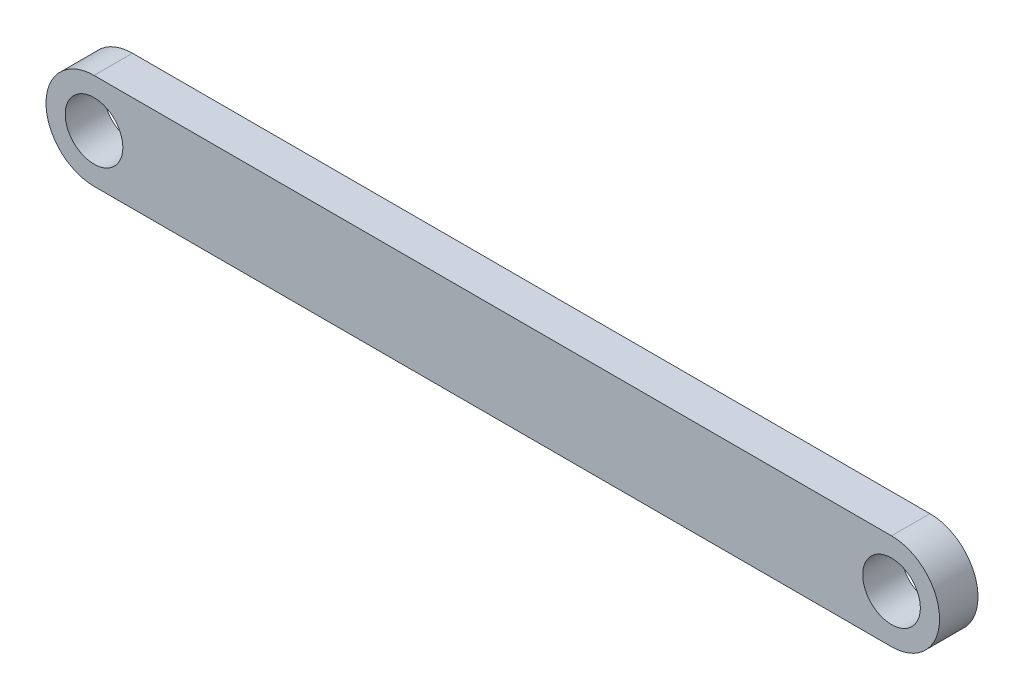
ISO-10303-21;
HEADER;
FILE_DESCRIPTION(('STEP AP214'),'2;1');
FILE_NAME('part.step','',(''),(''),'','','');
FILE_SCHEMA(('AUTOMOTIVE_DESIGN { 1 0 10303 214 1 1 1 1 }'));
ENDSEC;
DATA;
#1=APPLICATION_CONTEXT('core data for automotive mechanical design processes');
#2=APPLICATION_PROTOCOL_DEFINITION('international standard','automotive_design',2000,#1);
#3=PRODUCT_CONTEXT('',#1,'mechanical');
#4=PRODUCT('Part','Part','',(#3));
#5=PRODUCT_RELATED_PRODUCT_CATEGORY('part','',(#4));
#6=PRODUCT_DEFINITION_FORMATION('','',#4);
#7=PRODUCT_DEFINITION_CONTEXT('part definition',#1,'design');
#8=PRODUCT_DEFINITION('design','',#6,#7);
#9=PRODUCT_DEFINITION_SHAPE('','',#8);
#10=(LENGTH_UNIT() NAMED_UNIT(*) SI_UNIT(.MILLI.,.METRE.));
#11=(NAMED_UNIT(*) PLANE_ANGLE_UNIT() SI_UNIT($,.RADIAN.));
#12=(NAMED_UNIT(*) SI_UNIT($,.STERADIAN.) SOLID_ANGLE_UNIT());
#13=UNCERTAINTY_MEASURE_WITH_UNIT(LENGTH_MEASURE(1.E-05),#10,'distance_accuracy_value','');
#14=(GEOMETRIC_REPRESENTATION_CONTEXT(3) GLOBAL_UNCERTAINTY_ASSIGNED_CONTEXT((#13)) GLOBAL_UNIT_ASSIGNED_CONTEXT((#10,
#11,#12)) REPRESENTATION_CONTEXT('',''));
#15=CARTESIAN_POINT('',(0.,0.,0.));
#16=DIRECTION('',(0.,0.,1.));
#17=DIRECTION('',(1.,0.,0.));
#18=AXIS2_PLACEMENT_3D('',#15,#16,#17);
#19=CARTESIAN_POINT('',(-0.0439047240528736,-0.0160420045859679,2.));
#20=DIRECTION('',(0.,0.,1.));
#21=DIRECTION('',(1.,0.,0.));
#22=AXIS2_PLACEMENT_3D('',#19,#20,#21);
#23=PLANE('',#22);
#24=CARTESIAN_POINT('',(-0.0439047240528736,-0.0160420045859679,2.));
#25=DIRECTION('',(0.,0.,1.));
#26=DIRECTION('',(1.,0.,0.));
#27=AXIS2_PLACEMENT_3D('',#24,#25,#26);
#28=CIRCLE('',#27,1.5);
#29=CARTESIAN_POINT('',(1.45609527594713,-0.0160420045859679,2.));
#30=VERTEX_POINT('',#29);
#31=EDGE_CURVE('E101',#30,#30,#28,.T.);
#32=ORIENTED_EDGE('',*,*,#31,.F.);
#33=EDGE_LOOP('',(#32));
#34=FACE_BOUND('',#33,.T.);
#35=CARTESIAN_POINT('',(-0.0439047240528736,-0.0160420045859679,2.));
#36=DIRECTION('',(0.,0.,1.));
#37=DIRECTION('',(1.,0.,0.));
#38=AXIS2_PLACEMENT_3D('',#35,#36,#37);
#39=CIRCLE('',#38,2.5);
#40=CARTESIAN_POINT('',(-0.0439047240528736,2.48395799541403,2.));
#41=VERTEX_POINT('',#40);
#42=CARTESIAN_POINT('',(-0.0439047240528736,-2.51604200458597,2.));
#43=VERTEX_POINT('',#42);
#44=EDGE_CURVE('E86',#41,#43,#39,.T.);
#45=ORIENTED_EDGE('',*,*,#44,.T.);
#46=DIRECTION('',(1.,0.,0.));
#47=VECTOR('',#46,1.);
#48=CARTESIAN_POINT('',(-0.0439047240528736,-2.51604200458597,2.));
#49=LINE('',#48,#47);
#50=CARTESIAN_POINT('',(41.4560952759471,-2.51604200458597,2.));
#51=VERTEX_POINT('',#50);
#52=EDGE_CURVE('E81',#43,#51,#49,.T.);
#53=ORIENTED_EDGE('',*,*,#52,.T.);
#54=CARTESIAN_POINT('',(41.4560952759471,-0.0160420045859679,2.));
#55=DIRECTION('',(0.,0.,1.));
#56=DIRECTION('',(1.,0.,0.));
#57=AXIS2_PLACEMENT_3D('',#54,#55,#56);
#58=CIRCLE('',#57,2.5);
#59=CARTESIAN_POINT('',(41.4560952759471,2.48395799541403,2.));
#60=VERTEX_POINT('',#59);
#61=EDGE_CURVE('E84',#51,#60,#58,.T.);
#62=ORIENTED_EDGE('',*,*,#61,.T.);
#63=DIRECTION('',(-1.,0.,0.));
#64=VECTOR('',#63,1.);
#65=CARTESIAN_POINT('',(-0.0439047240528736,2.48395799541403,2.));
#66=LINE('',#65,#64);
#67=EDGE_CURVE('E51',#60,#41,#66,.T.);
#68=ORIENTED_EDGE('',*,*,#67,.T.);
#69=EDGE_LOOP('',(#45,#53,#62,#68));
#70=FACE_BOUND('',#69,.T.);
#71=CARTESIAN_POINT('',(41.4560952759471,-0.0160420045859679,2.));
#72=DIRECTION('',(0.,0.,1.));
#73=DIRECTION('',(1.,0.,0.));
#74=AXIS2_PLACEMENT_3D('',#71,#72,#73);
#75=CIRCLE('',#74,1.5);
#76=CARTESIAN_POINT('',(42.9560952759471,-0.0160420045859679,2.));
#77=VERTEX_POINT('',#76);
#78=EDGE_CURVE('E116',#77,#77,#75,.T.);
#79=ORIENTED_EDGE('',*,*,#78,.F.);
#80=EDGE_LOOP('',(#79));
#81=FACE_BOUND('',#80,.T.);
#82=ADVANCED_FACE('F34',(#34,#70,#81),#23,.T.);
#83=CARTESIAN_POINT('',(-0.0439047240528736,-0.0160420045859679,0.));
#84=DIRECTION('',(0.,0.,1.));
#85=DIRECTION('',(1.,0.,0.));
#86=AXIS2_PLACEMENT_3D('',#83,#84,#85);
#87=PLANE('',#86);
#88=CARTESIAN_POINT('',(-0.0439047240528736,-0.0160420045859679,0.));
#89=DIRECTION('',(0.,0.,1.));
#90=DIRECTION('',(1.,0.,0.));
#91=AXIS2_PLACEMENT_3D('',#88,#89,#90);
#92=CIRCLE('',#91,2.5);
#93=CARTESIAN_POINT('',(-0.0439047240528736,2.48395799541403,0.));
#94=VERTEX_POINT('',#93);
#95=CARTESIAN_POINT('',(-0.0439047240528736,-2.51604200458597,0.));
#96=VERTEX_POINT('',#95);
#97=EDGE_CURVE('E98',#94,#96,#92,.T.);
#98=ORIENTED_EDGE('',*,*,#97,.F.);
#99=DIRECTION('',(-1.,0.,0.));
#100=VECTOR('',#99,1.);
#101=CARTESIAN_POINT('',(-0.0439047240528736,2.48395799541403,0.));
#102=LINE('',#101,#100);
#103=CARTESIAN_POINT('',(41.4560952759471,2.48395799541403,0.));
#104=VERTEX_POINT('',#103);
#105=EDGE_CURVE('E74',#104,#94,#102,.T.);
#106=ORIENTED_EDGE('',*,*,#105,.F.);
#107=CARTESIAN_POINT('',(41.4560952759471,-0.0160420045859679,0.));
#108=DIRECTION('',(0.,0.,1.));
#109=DIRECTION('',(1.,0.,0.));
#110=AXIS2_PLACEMENT_3D('',#107,#108,#109);
#111=CIRCLE('',#110,2.5);
#112=CARTESIAN_POINT('',(41.4560952759471,-2.51604200458597,0.));
#113=VERTEX_POINT('',#112);
#114=EDGE_CURVE('E68',#113,#104,#111,.T.);
#115=ORIENTED_EDGE('',*,*,#114,.F.);
#116=DIRECTION('',(1.,0.,0.));
#117=VECTOR('',#116,1.);
#118=CARTESIAN_POINT('',(-0.0439047240528736,-2.51604200458597,0.));
#119=LINE('',#118,#117);
#120=EDGE_CURVE('E90',#96,#113,#119,.T.);
#121=ORIENTED_EDGE('',*,*,#120,.F.);
#122=EDGE_LOOP('',(#98,#106,#115,#121));
#123=FACE_BOUND('',#122,.T.);
#124=CARTESIAN_POINT('',(-0.0439047240528736,-0.0160420045859679,0.));
#125=DIRECTION('',(0.,0.,1.));
#126=DIRECTION('',(1.,0.,0.));
#127=AXIS2_PLACEMENT_3D('',#124,#125,#126);
#128=CIRCLE('',#127,1.5);
#129=CARTESIAN_POINT('',(1.45609527594713,-0.0160420045859679,0.));
#130=VERTEX_POINT('',#129);
#131=EDGE_CURVE('E113',#130,#130,#128,.T.);
#132=ORIENTED_EDGE('',*,*,#131,.T.);
#133=EDGE_LOOP('',(#132));
#134=FACE_BOUND('',#133,.T.);
#135=CARTESIAN_POINT('',(41.4560952759471,-0.0160420045859679,0.));
#136=DIRECTION('',(0.,0.,1.));
#137=DIRECTION('',(1.,0.,0.));
#138=AXIS2_PLACEMENT_3D('',#135,#136,#137);
#139=CIRCLE('',#138,1.5);
#140=CARTESIAN_POINT('',(42.9560952759471,-0.0160420045859679,0.));
#141=VERTEX_POINT('',#140);
#142=EDGE_CURVE('E119',#141,#141,#139,.T.);
#143=ORIENTED_EDGE('',*,*,#142,.T.);
#144=EDGE_LOOP('',(#143));
#145=FACE_BOUND('',#144,.T.);
#146=ADVANCED_FACE('F109',(#123,#134,#145),#87,.F.);
#147=CARTESIAN_POINT('',(-0.0439047240528736,-0.0160420045859679,2.));
#148=DIRECTION('',(0.,0.,-1.));
#149=DIRECTION('',(-1.,0.,0.));
#150=AXIS2_PLACEMENT_3D('',#147,#148,#149);
#151=CYLINDRICAL_SURFACE('',#150,2.5);
#152=ORIENTED_EDGE('',*,*,#97,.T.);
#153=DIRECTION('',(0.,0.,-1.));
#154=VECTOR('',#153,1.);
#155=CARTESIAN_POINT('',(-0.0439047240528736,-2.51604200458597,2.));
#156=LINE('',#155,#154);
#157=EDGE_CURVE('E11',#43,#96,#156,.T.);
#158=ORIENTED_EDGE('',*,*,#157,.F.);
#159=ORIENTED_EDGE('',*,*,#44,.F.);
#160=DIRECTION('',(0.,0.,-1.));
#161=VECTOR('',#160,1.);
#162=CARTESIAN_POINT('',(-0.0439047240528736,2.48395799541403,2.));
#163=LINE('',#162,#161);
#164=EDGE_CURVE('E94',#41,#94,#163,.T.);
#165=ORIENTED_EDGE('',*,*,#164,.T.);
#166=EDGE_LOOP('',(#152,#158,#159,#165));
#167=FACE_BOUND('',#166,.T.);
#168=ADVANCED_FACE('F36',(#167),#151,.T.);
#169=CARTESIAN_POINT('',(-0.0439047240528736,-2.51604200458597,2.));
#170=DIRECTION('',(0.,1.,0.));
#171=DIRECTION('',(-1.,0.,0.));
#172=AXIS2_PLACEMENT_3D('',#169,#170,#171);
#173=PLANE('',#172);
#174=ORIENTED_EDGE('',*,*,#120,.T.);
#175=DIRECTION('',(0.,0.,-1.));
#176=VECTOR('',#175,1.);
#177=CARTESIAN_POINT('',(41.4560952759471,-2.51604200458597,2.));
#178=LINE('',#177,#176);
#179=EDGE_CURVE('E43',#51,#113,#178,.T.);
#180=ORIENTED_EDGE('',*,*,#179,.F.);
#181=ORIENTED_EDGE('',*,*,#52,.F.);
#182=ORIENTED_EDGE('',*,*,#157,.T.);
#183=EDGE_LOOP('',(#174,#180,#181,#182));
#184=FACE_BOUND('',#183,.T.);
#185=ADVANCED_FACE('F89',(#184),#173,.F.);
#186=CARTESIAN_POINT('',(41.4560952759471,-0.0160420045859679,2.));
#187=DIRECTION('',(0.,0.,-1.));
#188=DIRECTION('',(-1.,0.,0.));
#189=AXIS2_PLACEMENT_3D('',#186,#187,#188);
#190=CYLINDRICAL_SURFACE('',#189,2.5);
#191=ORIENTED_EDGE('',*,*,#114,.T.);
#192=DIRECTION('',(0.,0.,-1.));
#193=VECTOR('',#192,1.);
#194=CARTESIAN_POINT('',(41.4560952759471,2.48395799541403,2.));
#195=LINE('',#194,#193);
#196=EDGE_CURVE('E91',#60,#104,#195,.T.);
#197=ORIENTED_EDGE('',*,*,#196,.F.);
#198=ORIENTED_EDGE('',*,*,#61,.F.);
#199=ORIENTED_EDGE('',*,*,#179,.T.);
#200=EDGE_LOOP('',(#191,#197,#198,#199));
#201=FACE_BOUND('',#200,.T.);
#202=ADVANCED_FACE('F92',(#201),#190,.T.);
#203=CARTESIAN_POINT('',(-0.0439047240528736,2.48395799541403,2.));
#204=DIRECTION('',(0.,-1.,0.));
#205=DIRECTION('',(1.,0.,0.));
#206=AXIS2_PLACEMENT_3D('',#203,#204,#205);
#207=PLANE('',#206);
#208=ORIENTED_EDGE('',*,*,#105,.T.);
#209=ORIENTED_EDGE('',*,*,#164,.F.);
#210=ORIENTED_EDGE('',*,*,#67,.F.);
#211=ORIENTED_EDGE('',*,*,#196,.T.);
#212=EDGE_LOOP('',(#208,#209,#210,#211));
#213=FACE_BOUND('',#212,.T.);
#214=ADVANCED_FACE('F106',(#213),#207,.F.);
#215=CARTESIAN_POINT('',(-0.0439047240528736,-0.0160420045859679,2.));
#216=DIRECTION('',(0.,0.,-1.));
#217=DIRECTION('',(-1.,0.,0.));
#218=AXIS2_PLACEMENT_3D('',#215,#216,#217);
#219=CYLINDRICAL_SURFACE('',#218,1.5);
#220=ORIENTED_EDGE('',*,*,#31,.T.);
#221=EDGE_LOOP('',(#220));
#222=FACE_BOUND('',#221,.T.);
#223=ORIENTED_EDGE('',*,*,#131,.F.);
#224=EDGE_LOOP('',(#223));
#225=FACE_BOUND('',#224,.T.);
#226=ADVANCED_FACE('F136',(#222,#225),#219,.F.);
#227=CARTESIAN_POINT('',(41.4560952759471,-0.0160420045859679,2.));
#228=DIRECTION('',(0.,0.,-1.));
#229=DIRECTION('',(-1.,0.,0.));
#230=AXIS2_PLACEMENT_3D('',#227,#228,#229);
#231=CYLINDRICAL_SURFACE('',#230,1.5);
#232=ORIENTED_EDGE('',*,*,#78,.T.);
#233=EDGE_LOOP('',(#232));
#234=FACE_BOUND('',#233,.T.);
#235=ORIENTED_EDGE('',*,*,#142,.F.);
#236=EDGE_LOOP('',(#235));
#237=FACE_BOUND('',#236,.T.);
#238=ADVANCED_FACE('F125',(#234,#237),#231,.F.);
#239=CLOSED_SHELL('',(#82,#146,#168,#185,#202,#214,#226,#238));
#240=MANIFOLD_SOLID_BREP('B2',#239);
#241=ADVANCED_BREP_SHAPE_REPRESENTATION('',(#18,#240),#14);
#242=SHAPE_DEFINITION_REPRESENTATION(#9,#241);
ENDSEC;
END-ISO-10303-21;
